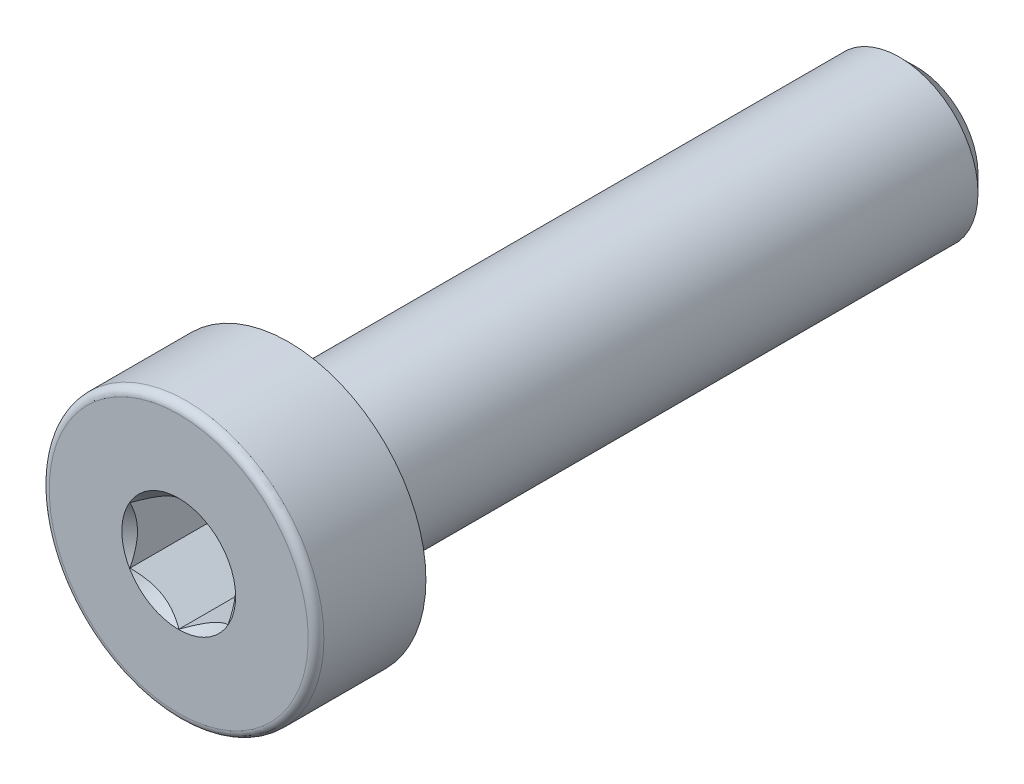
ISO-10303-21;
HEADER;
FILE_DESCRIPTION(('STEP AP214'),'2;1');
FILE_NAME('part.step','',(''),(''),'','','');
FILE_SCHEMA(('AUTOMOTIVE_DESIGN { 1 0 10303 214 1 1 1 1 }'));
ENDSEC;
DATA;
#1=APPLICATION_CONTEXT('core data for automotive mechanical design processes');
#2=APPLICATION_PROTOCOL_DEFINITION('international standard','automotive_design',2000,#1);
#3=PRODUCT_CONTEXT('',#1,'mechanical');
#4=PRODUCT('Part','Part','',(#3));
#5=PRODUCT_RELATED_PRODUCT_CATEGORY('part','',(#4));
#6=PRODUCT_DEFINITION_FORMATION('','',#4);
#7=PRODUCT_DEFINITION_CONTEXT('part definition',#1,'design');
#8=PRODUCT_DEFINITION('design','',#6,#7);
#9=PRODUCT_DEFINITION_SHAPE('','',#8);
#10=(LENGTH_UNIT() NAMED_UNIT(*) SI_UNIT(.MILLI.,.METRE.));
#11=(NAMED_UNIT(*) PLANE_ANGLE_UNIT() SI_UNIT($,.RADIAN.));
#12=(NAMED_UNIT(*) SI_UNIT($,.STERADIAN.) SOLID_ANGLE_UNIT());
#13=UNCERTAINTY_MEASURE_WITH_UNIT(LENGTH_MEASURE(1.E-05),#10,'distance_accuracy_value','');
#14=(GEOMETRIC_REPRESENTATION_CONTEXT(3) GLOBAL_UNCERTAINTY_ASSIGNED_CONTEXT((#13)) GLOBAL_UNIT_ASSIGNED_CONTEXT((#10,
#11,#12)) REPRESENTATION_CONTEXT('',''));
#15=CARTESIAN_POINT('',(0.,0.,0.));
#16=DIRECTION('',(0.,0.,1.));
#17=DIRECTION('',(1.,0.,0.));
#18=AXIS2_PLACEMENT_3D('',#15,#16,#17);
#19=CARTESIAN_POINT('',(1.25,-14.778312163513,11.6));
#20=DIRECTION('',(0.5,0.866025403784439,0.));
#21=DIRECTION('',(-0.866025403784439,0.5,0.));
#22=AXIS2_PLACEMENT_3D('',#19,#20,#21);
#23=PLANE('',#22);
#24=DIRECTION('',(0.,0.,1.));
#25=VECTOR('',#24,1.);
#26=CARTESIAN_POINT('',(0.,-14.0566243270259,11.6));
#27=LINE('',#26,#25);
#28=CARTESIAN_POINT('',(1.64581268235136E-12,-14.0566243269487,11.5933756731112));
#29=VERTEX_POINT('',#28);
#30=CARTESIAN_POINT('',(0.,-14.0566243270259,9.3));
#31=VERTEX_POINT('',#30);
#32=EDGE_CURVE('E79',#29,#31,#27,.F.);
#33=ORIENTED_EDGE('',*,*,#32,.T.);
#34=DIRECTION('',(-0.866025403784439,0.5,0.));
#35=VECTOR('',#34,1.);
#36=CARTESIAN_POINT('',(1.25,-14.778312163513,9.3));
#37=LINE('',#36,#35);
#38=CARTESIAN_POINT('',(1.25,-14.778312163513,9.3));
#39=VERTEX_POINT('',#38);
#40=EDGE_CURVE('E85',#39,#31,#37,.T.);
#41=ORIENTED_EDGE('',*,*,#40,.F.);
#42=DIRECTION('',(0.,0.,-1.));
#43=VECTOR('',#42,1.);
#44=CARTESIAN_POINT('',(1.25,-14.778312163513,11.6));
#45=LINE('',#44,#43);
#46=CARTESIAN_POINT('',(1.25000000000369,-14.7783121635151,11.5933756729549));
#47=VERTEX_POINT('',#46);
#48=EDGE_CURVE('E82',#39,#47,#45,.F.);
#49=ORIENTED_EDGE('',*,*,#48,.T.);
#50=CARTESIAN_POINT('',(3.29149995161725E-12,-14.0566243270279,11.5933756729508));
#51=CARTESIAN_POINT('',(0.042963108507114,-14.0814290892878,11.5685947126691));
#52=CARTESIAN_POINT('',(0.0866445640485576,-14.1066485894032,11.545269422414));
#53=CARTESIAN_POINT('',(0.175715534565842,-14.1580737382084,11.5025618118616));
#54=CARTESIAN_POINT('',(0.221113515566961,-14.18428427476,11.4832032463008));
#55=CARTESIAN_POINT('',(0.312656311479391,-14.2371365326224,11.4500418888551));
#56=CARTESIAN_POINT('',(0.358777825859558,-14.2637648013653,11.4361557697256));
#57=CARTESIAN_POINT('',(0.452035961109251,-14.3176074108558,11.4147615747423));
#58=CARTESIAN_POINT('',(0.499169735066733,-14.3448201079381,11.4072375348641));
#59=CARTESIAN_POINT('',(0.58040908647834,-14.3917236693443,11.4004485007388));
#60=CARTESIAN_POINT('',(0.614409822015773,-14.4113540031595,11.3994438615974));
#61=CARTESIAN_POINT('',(0.682351445324739,-14.4505801176661,11.4011391681639));
#62=CARTESIAN_POINT('',(0.716292318217976,-14.4701758897676,11.4038399322043));
#63=CARTESIAN_POINT('',(0.783846380264461,-14.509178245675,11.4127899212877));
#64=CARTESIAN_POINT('',(0.817459235102785,-14.5285846364641,11.419042446));
#65=CARTESIAN_POINT('',(0.884123739242497,-14.5670734058746,11.4347592121883));
#66=CARTESIAN_POINT('',(0.917175141331677,-14.5861556417678,11.4442248318012));
#67=CARTESIAN_POINT('',(1.00178643006583,-14.635005992095,11.4723040045233));
#68=CARTESIAN_POINT('',(1.05281387557123,-14.6644667014936,11.4930250180075));
#69=CARTESIAN_POINT('',(1.15287239438391,-14.7222355142648,11.5396991787649));
#70=CARTESIAN_POINT('',(1.20190935746894,-14.7505470181022,11.5656352941777));
#71=CARTESIAN_POINT('',(1.25000000000739,-14.7783121635173,11.593375672957));
#72=B_SPLINE_CURVE_WITH_KNOTS('',3,(#50,#51,#52,#53,#54,#55,#56,#57,#58,#59,#60,#61,#62,#63,#64,
#65,#66,#67,#68,#69,#70,#71),.UNSPECIFIED.,.F.,.F.,(4,2,2,2,2,2,2,2,2,2,4),(0.,
0.166478683224982,0.333926926831084,0.498716658515781,0.663091654624991,0.780745575556922,
0.898425484349913,1.01621489976866,1.13405490052282,1.32111591641664,1.50757565759148),.UNSPECIFIED.);
#73=EDGE_CURVE('E76',#29,#47,#72,.T.);
#74=ORIENTED_EDGE('',*,*,#73,.F.);
#75=EDGE_LOOP('',(#33,#41,#49,#74));
#76=FACE_BOUND('',#75,.T.);
#77=ADVANCED_FACE('F16',(#76),#23,.F.);
#78=CARTESIAN_POINT('',(0.,-14.0566243270259,11.6));
#79=DIRECTION('',(-0.5,0.866025403784439,0.));
#80=DIRECTION('',(-0.866025403784439,-0.5,0.));
#81=AXIS2_PLACEMENT_3D('',#78,#79,#80);
#82=PLANE('',#81);
#83=DIRECTION('',(0.,0.,1.));
#84=VECTOR('',#83,1.);
#85=CARTESIAN_POINT('',(-1.25,-14.778312163513,11.6));
#86=LINE('',#85,#84);
#87=CARTESIAN_POINT('',(-1.2500000000037,-14.7783121635108,11.5933756729571));
#88=VERTEX_POINT('',#87);
#89=CARTESIAN_POINT('',(-1.25000000000001,-14.778312163513,9.3));
#90=VERTEX_POINT('',#89);
#91=EDGE_CURVE('E162',#88,#90,#86,.F.);
#92=ORIENTED_EDGE('',*,*,#91,.T.);
#93=DIRECTION('',(-0.866025403784439,-0.5,0.));
#94=VECTOR('',#93,1.);
#95=CARTESIAN_POINT('',(0.,-14.0566243270259,9.3));
#96=LINE('',#95,#94);
#97=EDGE_CURVE('E96',#31,#90,#96,.T.);
#98=ORIENTED_EDGE('',*,*,#97,.F.);
#99=ORIENTED_EDGE('',*,*,#32,.F.);
#100=CARTESIAN_POINT('',(-1.2500000000074,-14.7783121635172,11.5933756729571));
#101=CARTESIAN_POINT('',(-1.20703689150295,-14.7535074012569,11.5685947126746));
#102=CARTESIAN_POINT('',(-1.16335543596087,-14.7282879011411,11.5452694224189));
#103=CARTESIAN_POINT('',(-1.07428446544223,-14.6768627523352,11.5025618118652));
#104=CARTESIAN_POINT('',(-1.02888648444041,-14.6506522157831,11.4832032463038));
#105=CARTESIAN_POINT('',(-0.937343688526511,-14.5977999579199,11.450041888857));
#106=CARTESIAN_POINT('',(-0.891222174145582,-14.5711716891766,11.4361557697271));
#107=CARTESIAN_POINT('',(-0.797964038894315,-14.5173290796852,11.414761574743));
#108=CARTESIAN_POINT('',(-0.750830264936023,-14.4901163826024,11.4072375348645));
#109=CARTESIAN_POINT('',(-0.669590913523556,-14.4432128211957,11.400448500739));
#110=CARTESIAN_POINT('',(-0.635590177986083,-14.4235824873804,11.3994438615974));
#111=CARTESIAN_POINT('',(-0.567648554677033,-14.3843563728738,11.4011391681639));
#112=CARTESIAN_POINT('',(-0.533707681783751,-14.3647606007723,11.4038399322042));
#113=CARTESIAN_POINT('',(-0.466153619737185,-14.3257582448649,11.4127899212874));
#114=CARTESIAN_POINT('',(-0.432540764898824,-14.3063518540757,11.4190424459997));
#115=CARTESIAN_POINT('',(-0.365876260759037,-14.2678630846652,11.4347592121879));
#116=CARTESIAN_POINT('',(-0.332824858669819,-14.2487808487719,11.4442248318008));
#117=CARTESIAN_POINT('',(-0.248213569937297,-14.1999304984457,11.4723040045222));
#118=CARTESIAN_POINT('',(-0.197186124433516,-14.1704697890481,11.4930250180055));
#119=CARTESIAN_POINT('',(-0.0971276056239278,-14.1127009762786,11.539699178761));
#120=CARTESIAN_POINT('',(-0.0480906425403792,-14.0843894724421,11.5656352941728));
#121=CARTESIAN_POINT('',(-3.34958436946761E-12,-14.0566243270278,11.5933756729509));
#122=B_SPLINE_CURVE_WITH_KNOTS('',3,(#100,#101,#102,#103,#104,#105,#106,#107,#108,#109,#110,
#111,#112,#113,#114,#115,#116,#117,#118,#119,#120,#121),.UNSPECIFIED.,.F.,.F.,(4,2,2,2,2,2,2,2,
2,2,4),(0.,0.166478683227834,0.333926926836856,0.498716658524458,0.663091654636543,
0.780745575568618,0.89842548436175,1.0162148997806,1.13405490053485,1.32111591642259,
1.50757565759142),.UNSPECIFIED.);
#123=EDGE_CURVE('E88',#88,#29,#122,.T.);
#124=ORIENTED_EDGE('',*,*,#123,.F.);
#125=EDGE_LOOP('',(#92,#98,#99,#124));
#126=FACE_BOUND('',#125,.T.);
#127=ADVANCED_FACE('F98',(#126),#82,.F.);
#128=CARTESIAN_POINT('',(1.25,-16.221687836487,11.6));
#129=DIRECTION('',(1.,0.,0.));
#130=DIRECTION('',(0.,0.,-1.));
#131=AXIS2_PLACEMENT_3D('',#128,#129,#130);
#132=PLANE('',#131);
#133=ORIENTED_EDGE('',*,*,#48,.F.);
#134=DIRECTION('',(0.,1.,0.));
#135=VECTOR('',#134,1.);
#136=CARTESIAN_POINT('',(1.25,-15.5,9.3));
#137=LINE('',#136,#135);
#138=CARTESIAN_POINT('',(1.25000000000002,-16.221687836487,9.3));
#139=VERTEX_POINT('',#138);
#140=EDGE_CURVE('E257',#139,#39,#137,.T.);
#141=ORIENTED_EDGE('',*,*,#140,.F.);
#142=DIRECTION('',(0.,0.,1.));
#143=VECTOR('',#142,1.);
#144=CARTESIAN_POINT('',(1.25000000000003,-16.2216878364871,11.6));
#145=LINE('',#144,#143);
#146=CARTESIAN_POINT('',(1.25000000000002,-16.2216878364913,11.5933756729549));
#147=VERTEX_POINT('',#146);
#148=EDGE_CURVE('E249',#139,#147,#145,.T.);
#149=ORIENTED_EDGE('',*,*,#148,.T.);
#150=CARTESIAN_POINT('',(1.25,-14.7783121635045,11.593375672957));
#151=CARTESIAN_POINT('',(1.25,-14.827921688025,11.5685947126746));
#152=CARTESIAN_POINT('',(1.25,-14.8783606882567,11.5452694224188));
#153=CARTESIAN_POINT('',(1.25,-14.9812109858685,11.5025618118651));
#154=CARTESIAN_POINT('',(1.25,-15.0336320589726,11.4832032463038));
#155=CARTESIAN_POINT('',(1.25,-15.1393365746992,11.450041888857));
#156=CARTESIAN_POINT('',(1.25,-15.1925931121857,11.436155769727));
#157=CARTESIAN_POINT('',(1.25,-15.3002783311685,11.4147615747429));
#158=CARTESIAN_POINT('',(1.25,-15.354703725334,11.4072375348645));
#159=CARTESIAN_POINT('',(1.25,-15.4485108481475,11.400448500739));
#160=CARTESIAN_POINT('',(1.25,-15.4877715157779,11.3994438615974));
#161=CARTESIAN_POINT('',(1.25,-15.5662237447913,11.4011391681638));
#162=CARTESIAN_POINT('',(1.25,-15.6054152889942,11.4038399322041));
#163=CARTESIAN_POINT('',(1.25,-15.6834200008091,11.4127899212874));
#164=CARTESIAN_POINT('',(1.25,-15.7222327823874,11.4190424459997));
#165=CARTESIAN_POINT('',(1.25,-15.7992103212084,11.4347592121879));
#166=CARTESIAN_POINT('',(1.25,-15.837374792995,11.4442248318008));
#167=CARTESIAN_POINT('',(1.25,-15.9350754936496,11.4723040045228));
#168=CARTESIAN_POINT('',(1.25,-15.9939969124471,11.4930250180071));
#169=CARTESIAN_POINT('',(1.25,-16.1095345379901,11.5396991787646));
#170=CARTESIAN_POINT('',(1.25,-16.1661575456651,11.5656352941776));
#171=CARTESIAN_POINT('',(1.25,-16.2216878364956,11.593375672957));
#172=B_SPLINE_CURVE_WITH_KNOTS('',3,(#150,#151,#152,#153,#154,#155,#156,#157,#158,#159,#160,
#161,#162,#163,#164,#165,#166,#167,#168,#169,#170,#171),.UNSPECIFIED.,.F.,.F.,(4,2,2,2,2,2,2,2,
2,2,4),(0.,0.166478683227865,0.333926926836917,0.498716658524476,0.663091654636521,
0.780745575568578,0.898425484361695,1.01621489978056,1.13405490053482,1.3211159164295,
1.50757565760522),.UNSPECIFIED.);
#173=EDGE_CURVE('E157',#47,#147,#172,.T.);
#174=ORIENTED_EDGE('',*,*,#173,.F.);
#175=EDGE_LOOP('',(#133,#141,#149,#174));
#176=FACE_BOUND('',#175,.T.);
#177=ADVANCED_FACE('F166',(#176),#132,.F.);
#178=CARTESIAN_POINT('',(-1.25,-14.778312163513,11.6));
#179=DIRECTION('',(-1.,0.,0.));
#180=DIRECTION('',(0.,0.,1.));
#181=AXIS2_PLACEMENT_3D('',#178,#179,#180);
#182=PLANE('',#181);
#183=DIRECTION('',(0.,0.,1.));
#184=VECTOR('',#183,1.);
#185=CARTESIAN_POINT('',(-1.25,-16.221687836487,11.6));
#186=LINE('',#185,#184);
#187=CARTESIAN_POINT('',(-1.25,-16.2216878364932,11.5933756729559));
#188=VERTEX_POINT('',#187);
#189=CARTESIAN_POINT('',(-1.25,-16.221687836487,9.3));
#190=VERTEX_POINT('',#189);
#191=EDGE_CURVE('E245',#188,#190,#186,.F.);
#192=ORIENTED_EDGE('',*,*,#191,.T.);
#193=DIRECTION('',(0.,1.,0.));
#194=VECTOR('',#193,1.);
#195=CARTESIAN_POINT('',(-1.25,-15.5,9.3));
#196=LINE('',#195,#194);
#197=EDGE_CURVE('E263',#90,#190,#196,.F.);
#198=ORIENTED_EDGE('',*,*,#197,.F.);
#199=ORIENTED_EDGE('',*,*,#91,.F.);
#200=CARTESIAN_POINT('',(-1.25,-16.2216878364994,11.5933756729589));
#201=CARTESIAN_POINT('',(-1.25,-16.1720783119786,11.5685947126763));
#202=CARTESIAN_POINT('',(-1.25,-16.1216393117467,11.5452694224203));
#203=CARTESIAN_POINT('',(-1.25,-16.0187890141344,11.5025618118662));
#204=CARTESIAN_POINT('',(-1.25,-15.96636794103,11.4832032463047));
#205=CARTESIAN_POINT('',(-1.25,-15.8606634253029,11.4500418888575));
#206=CARTESIAN_POINT('',(-1.25,-15.8074068878161,11.4361557697275));
#207=CARTESIAN_POINT('',(-1.25,-15.6997216688327,11.4147615747431));
#208=CARTESIAN_POINT('',(-1.25,-15.645296274667,11.4072375348646));
#209=CARTESIAN_POINT('',(-1.25,-15.5514891518531,11.400448500739));
#210=CARTESIAN_POINT('',(-1.25,-15.5122284842227,11.3994438615974));
#211=CARTESIAN_POINT('',(-1.25,-15.4337762552094,11.4011391681638));
#212=CARTESIAN_POINT('',(-1.25,-15.3945847110064,11.4038399322041));
#213=CARTESIAN_POINT('',(-1.25,-15.3165799991915,11.4127899212873));
#214=CARTESIAN_POINT('',(-1.25,-15.2777672176132,11.4190424459996));
#215=CARTESIAN_POINT('',(-1.25,-15.2007896787922,11.4347592121878));
#216=CARTESIAN_POINT('',(-1.25,-15.1626252070055,11.4442248318006));
#217=CARTESIAN_POINT('',(-1.25,-15.0649245063508,11.4723040045227));
#218=CARTESIAN_POINT('',(-1.25,-15.0060030875532,11.4930250180069));
#219=CARTESIAN_POINT('',(-1.25,-14.8904654620101,11.5396991787646));
#220=CARTESIAN_POINT('',(-1.25,-14.8338424543349,11.5656352941776));
#221=CARTESIAN_POINT('',(-1.25,-14.7783121635045,11.593375672957));
#222=B_SPLINE_CURVE_WITH_KNOTS('',3,(#200,#201,#202,#203,#204,#205,#206,#207,#208,#209,#210,
#211,#212,#213,#214,#215,#216,#217,#218,#219,#220,#221),.UNSPECIFIED.,.F.,.F.,(4,2,2,2,2,2,2,2,
2,2,4),(0.,0.166478683228755,0.333926926838722,0.498716658527172,0.663091654640097,
0.780745575572196,0.89842548436535,1.01621489978425,1.13405490053854,1.32111591643349,
1.50757565760948),.UNSPECIFIED.);
#223=EDGE_CURVE('E92',#188,#88,#222,.T.);
#224=ORIENTED_EDGE('',*,*,#223,.F.);
#225=EDGE_LOOP('',(#192,#198,#199,#224));
#226=FACE_BOUND('',#225,.T.);
#227=ADVANCED_FACE('F169',(#226),#182,.F.);
#228=CARTESIAN_POINT('',(0.,-15.5,9.3));
#229=DIRECTION('',(0.,0.,1.));
#230=DIRECTION('',(1.,0.,0.));
#231=AXIS2_PLACEMENT_3D('',#228,#229,#230);
#232=PLANE('',#231);
#233=DIRECTION('',(0.866025403784439,0.5,0.));
#234=VECTOR('',#233,1.);
#235=CARTESIAN_POINT('',(0.,-16.9433756729741,9.3));
#236=LINE('',#235,#234);
#237=CARTESIAN_POINT('',(0.,-16.9433756729741,9.3));
#238=VERTEX_POINT('',#237);
#239=EDGE_CURVE('E252',#238,#139,#236,.T.);
#240=ORIENTED_EDGE('',*,*,#239,.T.);
#241=ORIENTED_EDGE('',*,*,#140,.T.);
#242=ORIENTED_EDGE('',*,*,#40,.T.);
#243=ORIENTED_EDGE('',*,*,#97,.T.);
#244=ORIENTED_EDGE('',*,*,#197,.T.);
#245=DIRECTION('',(0.866025403784439,-0.5,0.));
#246=VECTOR('',#245,1.);
#247=CARTESIAN_POINT('',(-1.25,-16.221687836487,9.3));
#248=LINE('',#247,#246);
#249=EDGE_CURVE('E242',#190,#238,#248,.T.);
#250=ORIENTED_EDGE('',*,*,#249,.T.);
#251=EDGE_LOOP('',(#240,#241,#242,#243,#244,#250));
#252=FACE_BOUND('',#251,.T.);
#253=ADVANCED_FACE('F275',(#252),#232,.T.);
#254=CARTESIAN_POINT('',(0.,-16.9433756729741,11.6));
#255=DIRECTION('',(0.5,-0.866025403784439,0.));
#256=DIRECTION('',(0.866025403784439,0.5,0.));
#257=AXIS2_PLACEMENT_3D('',#254,#255,#256);
#258=PLANE('',#257);
#259=ORIENTED_EDGE('',*,*,#148,.F.);
#260=ORIENTED_EDGE('',*,*,#239,.F.);
#261=DIRECTION('',(0.,0.,1.));
#262=VECTOR('',#261,1.);
#263=CARTESIAN_POINT('',(0.,-16.943375672974,11.6));
#264=LINE('',#263,#262);
#265=CARTESIAN_POINT('',(0.,-16.9433756729543,11.5933756729306));
#266=VERTEX_POINT('',#265);
#267=EDGE_CURVE('E130',#238,#266,#264,.T.);
#268=ORIENTED_EDGE('',*,*,#267,.T.);
#269=CARTESIAN_POINT('',(1.2500000000074,-16.2216878364828,11.5933756729571));
#270=CARTESIAN_POINT('',(1.20703689150295,-16.2464925987431,11.5685947126746));
#271=CARTESIAN_POINT('',(1.16335543596086,-16.2717120988589,11.5452694224189));
#272=CARTESIAN_POINT('',(1.07428446544222,-16.3231372476648,11.5025618118652));
#273=CARTESIAN_POINT('',(1.0288864844404,-16.3493477842169,11.4832032463038));
#274=CARTESIAN_POINT('',(0.937343688526499,-16.4022000420801,11.450041888857));
#275=CARTESIAN_POINT('',(0.891222174145572,-16.4288283108234,11.4361557697271));
#276=CARTESIAN_POINT('',(0.79796403889431,-16.4826709203148,11.414761574743));
#277=CARTESIAN_POINT('',(0.750830264936022,-16.5098836173976,11.4072375348645));
#278=CARTESIAN_POINT('',(0.669590913523559,-16.5567871788043,11.400448500739));
#279=CARTESIAN_POINT('',(0.635590177986087,-16.5764175126195,11.3994438615974));
#280=CARTESIAN_POINT('',(0.567648554677039,-16.6156436271262,11.4011391681639));
#281=CARTESIAN_POINT('',(0.533707681783758,-16.6352393992277,11.4038399322042));
#282=CARTESIAN_POINT('',(0.466153619737192,-16.6742417551351,11.4127899212874));
#283=CARTESIAN_POINT('',(0.43254076489883,-16.6936481459243,11.4190424459997));
#284=CARTESIAN_POINT('',(0.365876260759041,-16.7321369153348,11.4347592121879));
#285=CARTESIAN_POINT('',(0.332824858669821,-16.7512191512281,11.4442248318008));
#286=CARTESIAN_POINT('',(0.248213569936741,-16.8000695015546,11.4723040045224));
#287=CARTESIAN_POINT('',(0.197186124432422,-16.8295302109526,11.493025018006));
#288=CARTESIAN_POINT('',(0.0971276056218011,-16.8872990237226,11.5396991787621));
#289=CARTESIAN_POINT('',(0.0480906425377572,-16.9156105275594,11.5656352941742));
#290=CARTESIAN_POINT('',(2.50372132622813E-13,-16.943375672974,11.5933756729527));
#291=B_SPLINE_CURVE_WITH_KNOTS('',3,(#269,#270,#271,#272,#273,#274,#275,#276,#277,#278,#279,
#280,#281,#282,#283,#284,#285,#286,#287,#288,#289,#290),.UNSPECIFIED.,.F.,.F.,(4,2,2,2,2,2,2,2,
2,2,4),(0.,0.166478683227844,0.333926926836875,0.498716658524468,0.663091654636541,
0.780745575568614,0.898425484361742,1.0162148997806,1.13405490053485,1.3211159164246,
1.50757565759542),.UNSPECIFIED.);
#292=EDGE_CURVE('E131',#147,#266,#291,.T.);
#293=ORIENTED_EDGE('',*,*,#292,.F.);
#294=EDGE_LOOP('',(#259,#260,#268,#293));
#295=FACE_BOUND('',#294,.T.);
#296=ADVANCED_FACE('F281',(#295),#258,.F.);
#297=CARTESIAN_POINT('',(-1.25,-16.221687836487,11.6));
#298=DIRECTION('',(-0.5,-0.866025403784439,0.));
#299=DIRECTION('',(0.866025403784439,-0.5,0.));
#300=AXIS2_PLACEMENT_3D('',#297,#298,#299);
#301=PLANE('',#300);
#302=ORIENTED_EDGE('',*,*,#267,.F.);
#303=ORIENTED_EDGE('',*,*,#249,.F.);
#304=ORIENTED_EDGE('',*,*,#191,.F.);
#305=CARTESIAN_POINT('',(-1.25000000001029,-16.2216878364804,11.5933756729592));
#306=CARTESIAN_POINT('',(-1.20703689150592,-16.246492598741,11.5685947126764));
#307=CARTESIAN_POINT('',(-1.16335543596375,-16.2717120988571,11.5452694224204));
#308=CARTESIAN_POINT('',(-1.07428446544481,-16.3231372476633,11.5025618118662));
#309=CARTESIAN_POINT('',(-1.02888648444275,-16.3493477842155,11.4832032463047));
#310=CARTESIAN_POINT('',(-0.937343688528425,-16.4022000420789,11.4500418888576));
#311=CARTESIAN_POINT('',(-0.891222174147299,-16.4288283108223,11.4361557697275));
#312=CARTESIAN_POINT('',(-0.797964038895613,-16.482670920314,11.4147615747431));
#313=CARTESIAN_POINT('',(-0.750830264937099,-16.5098836173969,11.4072375348646));
#314=CARTESIAN_POINT('',(-0.669590913524409,-16.5567871788038,11.400448500739));
#315=CARTESIAN_POINT('',(-0.635590177986936,-16.576417512619,11.3994438615974));
#316=CARTESIAN_POINT('',(-0.567648554677883,-16.6156436271257,11.4011391681638));
#317=CARTESIAN_POINT('',(-0.533707681784598,-16.6352393992271,11.403839932204));
#318=CARTESIAN_POINT('',(-0.466153619738022,-16.6742417551346,11.4127899212872));
#319=CARTESIAN_POINT('',(-0.432540764899654,-16.6936481459237,11.4190424459995));
#320=CARTESIAN_POINT('',(-0.365876260759852,-16.7321369153342,11.4347592121877));
#321=CARTESIAN_POINT('',(-0.332824858670626,-16.7512191512275,11.4442248318005));
#322=CARTESIAN_POINT('',(-0.248213569937388,-16.8000695015542,11.4723040045221));
#323=CARTESIAN_POINT('',(-0.197186124432922,-16.8295302109522,11.4930250180057));
#324=CARTESIAN_POINT('',(-0.0971276056220142,-16.8872990237224,11.5396991787619));
#325=CARTESIAN_POINT('',(-0.0480906425378308,-16.9156105275593,11.5656352941741));
#326=CARTESIAN_POINT('',(-1.91630150461268E-13,-16.9433756729739,11.5933756729526));
#327=B_SPLINE_CURVE_WITH_KNOTS('',3,(#305,#306,#307,#308,#309,#310,#311,#312,#313,#314,#315,
#316,#317,#318,#319,#320,#321,#322,#323,#324,#325,#326),.UNSPECIFIED.,.F.,.F.,(4,2,2,2,2,2,2,2,
2,2,4),(0.,0.166478683228678,0.333926926838546,0.49871665852694,0.663091654639813,
0.780745575571893,0.898425484365026,1.01621489978389,1.13405490053815,1.32111591642841,
1.50757565759974),.UNSPECIFIED.);
#328=EDGE_CURVE('E122',#188,#266,#327,.T.);
#329=ORIENTED_EDGE('',*,*,#328,.T.);
#330=EDGE_LOOP('',(#302,#303,#304,#329));
#331=FACE_BOUND('',#330,.T.);
#332=ADVANCED_FACE('F137',(#331),#301,.F.);
#333=CARTESIAN_POINT('',(0.,-15.5,11.5999999999303));
#334=DIRECTION('',(0.,0.,1.));
#335=DIRECTION('',(1.,0.,0.));
#336=AXIS2_PLACEMENT_3D('',#333,#334,#335);
#337=CONICAL_SURFACE('',#336,1.44999999995161,0.785398163397448);
#338=ORIENTED_EDGE('',*,*,#123,.T.);
#339=ORIENTED_EDGE('',*,*,#73,.T.);
#340=ORIENTED_EDGE('',*,*,#173,.T.);
#341=ORIENTED_EDGE('',*,*,#292,.T.);
#342=ORIENTED_EDGE('',*,*,#328,.F.);
#343=ORIENTED_EDGE('',*,*,#223,.T.);
#344=EDGE_LOOP('',(#338,#339,#340,#341,#342,#343));
#345=FACE_BOUND('',#344,.T.);
#346=CARTESIAN_POINT('',(0.,-15.5,11.5999999999872));
#347=DIRECTION('',(0.,0.,1.));
#348=DIRECTION('',(1.,0.,0.));
#349=AXIS2_PLACEMENT_3D('',#346,#347,#348);
#350=CIRCLE('',#349,1.45000000000846);
#351=CARTESIAN_POINT('',(1.45000000000846,-15.5,11.5999999999872));
#352=VERTEX_POINT('',#351);
#353=EDGE_CURVE('E119',#352,#352,#350,.F.);
#354=ORIENTED_EDGE('',*,*,#353,.F.);
#355=EDGE_LOOP('',(#354));
#356=FACE_BOUND('',#355,.T.);
#357=ADVANCED_FACE('F89',(#345,#356),#337,.F.);
#358=CARTESIAN_POINT('',(0.,-17.875,11.6));
#359=DIRECTION('',(0.,0.,1.));
#360=DIRECTION('',(1.,0.,0.));
#361=AXIS2_PLACEMENT_3D('',#358,#359,#360);
#362=PLANE('',#361);
#363=CARTESIAN_POINT('',(0.,-15.5,11.6));
#364=DIRECTION('',(0.,0.,-1.));
#365=DIRECTION('',(0.,1.,0.));
#366=AXIS2_PLACEMENT_3D('',#363,#364,#365);
#367=CIRCLE('',#366,3.3);
#368=CARTESIAN_POINT('',(0.,-12.2,11.6));
#369=VERTEX_POINT('',#368);
#370=CARTESIAN_POINT('',(0.,-18.8,11.6));
#371=VERTEX_POINT('',#370);
#372=EDGE_CURVE('E36',#369,#371,#367,.T.);
#373=ORIENTED_EDGE('',*,*,#372,.F.);
#374=CARTESIAN_POINT('',(0.,-15.5,11.6));
#375=DIRECTION('',(0.,0.,-1.));
#376=DIRECTION('',(0.,-1.,0.));
#377=AXIS2_PLACEMENT_3D('',#374,#375,#376);
#378=CIRCLE('',#377,3.3);
#379=EDGE_CURVE('E223',#371,#369,#378,.T.);
#380=ORIENTED_EDGE('',*,*,#379,.F.);
#381=EDGE_LOOP('',(#373,#380));
#382=FACE_BOUND('',#381,.T.);
#383=ORIENTED_EDGE('',*,*,#353,.T.);
#384=EDGE_LOOP('',(#383));
#385=FACE_BOUND('',#384,.T.);
#386=ADVANCED_FACE('F142',(#382,#385),#362,.T.);
#387=CARTESIAN_POINT('',(0.,-15.5,11.4));
#388=DIRECTION('',(0.,0.,1.));
#389=DIRECTION('',(0.,-1.,0.));
#390=AXIS2_PLACEMENT_3D('',#387,#388,#389);
#391=TOROIDAL_SURFACE('',#390,3.3,0.199999999999999);
#392=ORIENTED_EDGE('',*,*,#372,.T.);
#393=ORIENTED_EDGE('',*,*,#379,.T.);
#394=EDGE_LOOP('',(#392,#393));
#395=FACE_BOUND('',#394,.T.);
#396=CARTESIAN_POINT('',(0.,-15.5,11.4));
#397=DIRECTION('',(0.,0.,-1.));
#398=DIRECTION('',(-1.,0.,0.));
#399=AXIS2_PLACEMENT_3D('',#396,#397,#398);
#400=CIRCLE('',#399,3.5);
#401=CARTESIAN_POINT('',(-3.5,-15.5,11.4));
#402=VERTEX_POINT('',#401);
#403=EDGE_CURVE('E118',#402,#402,#400,.T.);
#404=ORIENTED_EDGE('',*,*,#403,.F.);
#405=EDGE_LOOP('',(#404));
#406=FACE_BOUND('',#405,.T.);
#407=ADVANCED_FACE('F202',(#395,#406),#391,.T.);
#408=CARTESIAN_POINT('',(0.,-16.28525,-7.2));
#409=DIRECTION('',(0.,0.,-1.));
#410=DIRECTION('',(-1.,0.,0.));
#411=AXIS2_PLACEMENT_3D('',#408,#409,#410);
#412=PLANE('',#411);
#413=CARTESIAN_POINT('',(0.,-15.5,-7.20000000001164));
#414=DIRECTION('',(0.,0.,1.));
#415=DIRECTION('',(1.,0.,0.));
#416=AXIS2_PLACEMENT_3D('',#413,#414,#415);
#417=CIRCLE('',#416,1.57049999998844);
#418=CARTESIAN_POINT('',(1.57049999998844,-15.5,-7.20000000001164));
#419=VERTEX_POINT('',#418);
#420=EDGE_CURVE('E115',#419,#419,#417,.T.);
#421=ORIENTED_EDGE('',*,*,#420,.F.);
#422=EDGE_LOOP('',(#421));
#423=FACE_BOUND('',#422,.T.);
#424=ADVANCED_FACE('F199',(#423),#412,.T.);
#425=CARTESIAN_POINT('',(0.,-15.5,10.1));
#426=DIRECTION('',(0.,0.,-1.));
#427=DIRECTION('',(-1.,0.,0.));
#428=AXIS2_PLACEMENT_3D('',#425,#426,#427);
#429=CYLINDRICAL_SURFACE('',#428,3.5);
#430=ORIENTED_EDGE('',*,*,#403,.T.);
#431=EDGE_LOOP('',(#430));
#432=FACE_BOUND('',#431,.T.);
#433=CARTESIAN_POINT('',(0.,-15.5,8.8));
#434=DIRECTION('',(0.,0.,-1.));
#435=DIRECTION('',(-1.,0.,0.));
#436=AXIS2_PLACEMENT_3D('',#433,#434,#435);
#437=CIRCLE('',#436,3.5);
#438=CARTESIAN_POINT('',(-3.5,-15.5,8.8));
#439=VERTEX_POINT('',#438);
#440=EDGE_CURVE('E112',#439,#439,#437,.T.);
#441=ORIENTED_EDGE('',*,*,#440,.F.);
#442=EDGE_LOOP('',(#441));
#443=FACE_BOUND('',#442,.T.);
#444=ADVANCED_FACE('F195',(#432,#443),#429,.T.);
#445=CARTESIAN_POINT('',(0.,-15.5,-6.77050000007284));
#446=DIRECTION('',(0.,0.,1.));
#447=DIRECTION('',(1.,0.,0.));
#448=AXIS2_PLACEMENT_3D('',#445,#446,#447);
#449=CONICAL_SURFACE('',#448,1.99999999992724,0.785398163397448);
#450=ORIENTED_EDGE('',*,*,#420,.T.);
#451=EDGE_LOOP('',(#450));
#452=FACE_BOUND('',#451,.T.);
#453=CARTESIAN_POINT('',(0.,-15.5,-6.7705));
#454=DIRECTION('',(0.,0.,-1.));
#455=DIRECTION('',(-1.,0.,0.));
#456=AXIS2_PLACEMENT_3D('',#453,#454,#455);
#457=CIRCLE('',#456,2.);
#458=CARTESIAN_POINT('',(-2.,-15.5,-6.7705));
#459=VERTEX_POINT('',#458);
#460=EDGE_CURVE('E28',#459,#459,#457,.F.);
#461=ORIENTED_EDGE('',*,*,#460,.F.);
#462=EDGE_LOOP('',(#461));
#463=FACE_BOUND('',#462,.T.);
#464=ADVANCED_FACE('F187',(#452,#463),#449,.T.);
#465=CARTESIAN_POINT('',(0.,-18.25,8.8));
#466=DIRECTION('',(0.,0.,-1.));
#467=DIRECTION('',(-1.,0.,0.));
#468=AXIS2_PLACEMENT_3D('',#465,#466,#467);
#469=PLANE('',#468);
#470=CARTESIAN_POINT('',(0.,-15.5,8.8));
#471=DIRECTION('',(0.,0.,-1.));
#472=DIRECTION('',(-1.,0.,0.));
#473=AXIS2_PLACEMENT_3D('',#470,#471,#472);
#474=CIRCLE('',#473,2.);
#475=CARTESIAN_POINT('',(-2.,-15.5,8.8));
#476=VERTEX_POINT('',#475);
#477=EDGE_CURVE('E11',#476,#476,#474,.T.);
#478=ORIENTED_EDGE('',*,*,#477,.F.);
#479=EDGE_LOOP('',(#478));
#480=FACE_BOUND('',#479,.T.);
#481=ORIENTED_EDGE('',*,*,#440,.T.);
#482=EDGE_LOOP('',(#481));
#483=FACE_BOUND('',#482,.T.);
#484=ADVANCED_FACE('F181',(#480,#483),#469,.T.);
#485=CARTESIAN_POINT('',(0.,-15.5,1.01475));
#486=DIRECTION('',(0.,0.,-1.));
#487=DIRECTION('',(-1.,0.,0.));
#488=AXIS2_PLACEMENT_3D('',#485,#486,#487);
#489=CYLINDRICAL_SURFACE('',#488,2.);
#490=ORIENTED_EDGE('',*,*,#460,.T.);
#491=EDGE_LOOP('',(#490));
#492=FACE_BOUND('',#491,.T.);
#493=ORIENTED_EDGE('',*,*,#477,.T.);
#494=EDGE_LOOP('',(#493));
#495=FACE_BOUND('',#494,.T.);
#496=ADVANCED_FACE('F179',(#492,#495),#489,.T.);
#497=CLOSED_SHELL('',(#77,#127,#177,#227,#253,#296,#332,#357,#386,#407,#424,#444,#464,#484,#496));
#498=MANIFOLD_SOLID_BREP('B1',#497);
#499=ADVANCED_BREP_SHAPE_REPRESENTATION('',(#18,#498),#14);
#500=SHAPE_DEFINITION_REPRESENTATION(#9,#499);
ENDSEC;
END-ISO-10303-21;
